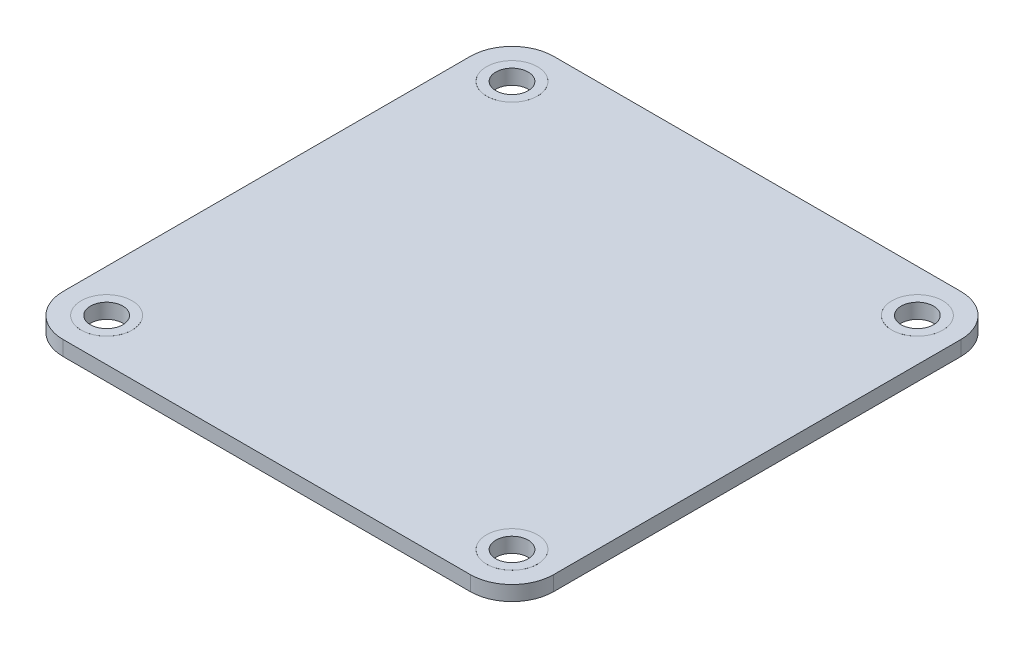
ISO-10303-21;
HEADER;
FILE_DESCRIPTION(('STEP AP214'),'2;1');
FILE_NAME('part.step','',(''),(''),'','','');
FILE_SCHEMA(('AUTOMOTIVE_DESIGN { 1 0 10303 214 1 1 1 1 }'));
ENDSEC;
DATA;
#1=APPLICATION_CONTEXT('core data for automotive mechanical design processes');
#2=APPLICATION_PROTOCOL_DEFINITION('international standard','automotive_design',2000,#1);
#3=PRODUCT_CONTEXT('',#1,'mechanical');
#4=PRODUCT('Part','Part','',(#3));
#5=PRODUCT_RELATED_PRODUCT_CATEGORY('part','',(#4));
#6=PRODUCT_DEFINITION_FORMATION('','',#4);
#7=PRODUCT_DEFINITION_CONTEXT('part definition',#1,'design');
#8=PRODUCT_DEFINITION('design','',#6,#7);
#9=PRODUCT_DEFINITION_SHAPE('','',#8);
#10=(LENGTH_UNIT() NAMED_UNIT(*) SI_UNIT(.MILLI.,.METRE.));
#11=(NAMED_UNIT(*) PLANE_ANGLE_UNIT() SI_UNIT($,.RADIAN.));
#12=(NAMED_UNIT(*) SI_UNIT($,.STERADIAN.) SOLID_ANGLE_UNIT());
#13=UNCERTAINTY_MEASURE_WITH_UNIT(LENGTH_MEASURE(1.E-05),#10,'distance_accuracy_value','');
#14=(GEOMETRIC_REPRESENTATION_CONTEXT(3) GLOBAL_UNCERTAINTY_ASSIGNED_CONTEXT((#13)) GLOBAL_UNIT_ASSIGNED_CONTEXT((#10,
#11,#12)) REPRESENTATION_CONTEXT('',''));
#15=CARTESIAN_POINT('',(0.,0.,0.));
#16=DIRECTION('',(0.,0.,1.));
#17=DIRECTION('',(1.,0.,0.));
#18=AXIS2_PLACEMENT_3D('',#15,#16,#17);
#19=CARTESIAN_POINT('',(-22.,1.6,-22.));
#20=DIRECTION('',(0.,-1.,0.));
#21=DIRECTION('',(0.,0.,-1.));
#22=AXIS2_PLACEMENT_3D('',#19,#20,#21);
#23=PLANE('',#22);
#24=CARTESIAN_POINT('',(21.9,1.6,21.9));
#25=DIRECTION('',(0.,-1.,0.));
#26=DIRECTION('',(0.,0.,-1.));
#27=AXIS2_PLACEMENT_3D('',#24,#25,#26);
#28=CIRCLE('',#27,2.75);
#29=CARTESIAN_POINT('',(21.9,1.6,19.15));
#30=VERTEX_POINT('',#29);
#31=EDGE_CURVE('E42',#30,#30,#28,.F.);
#32=ORIENTED_EDGE('',*,*,#31,.F.);
#33=EDGE_LOOP('',(#32));
#34=FACE_BOUND('',#33,.T.);
#35=CARTESIAN_POINT('',(-21.9,1.6,-21.9));
#36=DIRECTION('',(0.,-1.,0.));
#37=DIRECTION('',(0.,0.,-1.));
#38=AXIS2_PLACEMENT_3D('',#35,#36,#37);
#39=CIRCLE('',#38,2.75);
#40=CARTESIAN_POINT('',(-21.9,1.6,-24.65));
#41=VERTEX_POINT('',#40);
#42=EDGE_CURVE('E162',#41,#41,#39,.F.);
#43=ORIENTED_EDGE('',*,*,#42,.F.);
#44=EDGE_LOOP('',(#43));
#45=FACE_BOUND('',#44,.T.);
#46=CARTESIAN_POINT('',(-22.,1.6,-22.));
#47=DIRECTION('',(0.,1.,0.));
#48=DIRECTION('',(0.,0.,-1.));
#49=AXIS2_PLACEMENT_3D('',#46,#47,#48);
#50=CIRCLE('',#49,4.5);
#51=CARTESIAN_POINT('',(-22.,1.6,-26.5));
#52=VERTEX_POINT('',#51);
#53=CARTESIAN_POINT('',(-26.5,1.6,-22.));
#54=VERTEX_POINT('',#53);
#55=EDGE_CURVE('E147',#52,#54,#50,.T.);
#56=ORIENTED_EDGE('',*,*,#55,.T.);
#57=DIRECTION('',(0.,0.,1.));
#58=VECTOR('',#57,1.);
#59=CARTESIAN_POINT('',(-26.5,1.6,22.));
#60=LINE('',#59,#58);
#61=CARTESIAN_POINT('',(-26.5,1.6,22.));
#62=VERTEX_POINT('',#61);
#63=EDGE_CURVE('E95',#54,#62,#60,.T.);
#64=ORIENTED_EDGE('',*,*,#63,.T.);
#65=CARTESIAN_POINT('',(-22.,1.6,22.));
#66=DIRECTION('',(0.,1.,0.));
#67=DIRECTION('',(0.,0.,-1.));
#68=AXIS2_PLACEMENT_3D('',#65,#66,#67);
#69=CIRCLE('',#68,4.5);
#70=CARTESIAN_POINT('',(-22.,1.6,26.5));
#71=VERTEX_POINT('',#70);
#72=EDGE_CURVE('E217',#62,#71,#69,.T.);
#73=ORIENTED_EDGE('',*,*,#72,.T.);
#74=DIRECTION('',(1.,0.,0.));
#75=VECTOR('',#74,1.);
#76=CARTESIAN_POINT('',(22.,1.6,26.5));
#77=LINE('',#76,#75);
#78=CARTESIAN_POINT('',(22.,1.6,26.5));
#79=VERTEX_POINT('',#78);
#80=EDGE_CURVE('E219',#71,#79,#77,.T.);
#81=ORIENTED_EDGE('',*,*,#80,.T.);
#82=CARTESIAN_POINT('',(22.,1.6,22.));
#83=DIRECTION('',(0.,1.,0.));
#84=DIRECTION('',(0.,0.,-1.));
#85=AXIS2_PLACEMENT_3D('',#82,#83,#84);
#86=CIRCLE('',#85,4.5);
#87=CARTESIAN_POINT('',(26.5,1.6,22.));
#88=VERTEX_POINT('',#87);
#89=EDGE_CURVE('E114',#79,#88,#86,.T.);
#90=ORIENTED_EDGE('',*,*,#89,.T.);
#91=DIRECTION('',(0.,0.,-1.));
#92=VECTOR('',#91,1.);
#93=CARTESIAN_POINT('',(26.5,1.6,22.));
#94=LINE('',#93,#92);
#95=CARTESIAN_POINT('',(26.5,1.6,-22.));
#96=VERTEX_POINT('',#95);
#97=EDGE_CURVE('E108',#88,#96,#94,.T.);
#98=ORIENTED_EDGE('',*,*,#97,.T.);
#99=CARTESIAN_POINT('',(22.,1.6,-22.));
#100=DIRECTION('',(0.,1.,0.));
#101=DIRECTION('',(0.,0.,-1.));
#102=AXIS2_PLACEMENT_3D('',#99,#100,#101);
#103=CIRCLE('',#102,4.5);
#104=CARTESIAN_POINT('',(22.,1.6,-26.5));
#105=VERTEX_POINT('',#104);
#106=EDGE_CURVE('E112',#96,#105,#103,.T.);
#107=ORIENTED_EDGE('',*,*,#106,.T.);
#108=DIRECTION('',(-1.,0.,0.));
#109=VECTOR('',#108,1.);
#110=CARTESIAN_POINT('',(22.,1.6,-26.5));
#111=LINE('',#110,#109);
#112=EDGE_CURVE('E51',#105,#52,#111,.T.);
#113=ORIENTED_EDGE('',*,*,#112,.T.);
#114=EDGE_LOOP('',(#56,#64,#73,#81,#90,#98,#107,#113));
#115=FACE_BOUND('',#114,.T.);
#116=CARTESIAN_POINT('',(21.9,1.6,-21.9));
#117=DIRECTION('',(0.,-1.,0.));
#118=DIRECTION('',(0.,0.,-1.));
#119=AXIS2_PLACEMENT_3D('',#116,#117,#118);
#120=CIRCLE('',#119,2.75);
#121=CARTESIAN_POINT('',(21.9,1.6,-24.65));
#122=VERTEX_POINT('',#121);
#123=EDGE_CURVE('E193',#122,#122,#120,.F.);
#124=ORIENTED_EDGE('',*,*,#123,.F.);
#125=EDGE_LOOP('',(#124));
#126=FACE_BOUND('',#125,.T.);
#127=CARTESIAN_POINT('',(-21.9,1.6,21.9));
#128=DIRECTION('',(0.,-1.,0.));
#129=DIRECTION('',(0.,0.,-1.));
#130=AXIS2_PLACEMENT_3D('',#127,#128,#129);
#131=CIRCLE('',#130,2.75);
#132=CARTESIAN_POINT('',(-21.9,1.6,19.15));
#133=VERTEX_POINT('',#132);
#134=EDGE_CURVE('E11',#133,#133,#131,.F.);
#135=ORIENTED_EDGE('',*,*,#134,.F.);
#136=EDGE_LOOP('',(#135));
#137=FACE_BOUND('',#136,.T.);
#138=ADVANCED_FACE('F32',(#34,#45,#115,#126,#137),#23,.F.);
#139=CARTESIAN_POINT('',(-22.,0.,-22.));
#140=DIRECTION('',(0.,-1.,0.));
#141=DIRECTION('',(0.,0.,-1.));
#142=AXIS2_PLACEMENT_3D('',#139,#140,#141);
#143=PLANE('',#142);
#144=CARTESIAN_POINT('',(21.9,0.,21.9));
#145=DIRECTION('',(0.,-1.,0.));
#146=DIRECTION('',(0.,0.,-1.));
#147=AXIS2_PLACEMENT_3D('',#144,#145,#146);
#148=CIRCLE('',#147,2.75);
#149=CARTESIAN_POINT('',(21.9,0.,19.15));
#150=VERTEX_POINT('',#149);
#151=EDGE_CURVE('E170',#150,#150,#148,.F.);
#152=ORIENTED_EDGE('',*,*,#151,.T.);
#153=EDGE_LOOP('',(#152));
#154=FACE_BOUND('',#153,.T.);
#155=CARTESIAN_POINT('',(-21.9,0.,-21.9));
#156=DIRECTION('',(0.,-1.,0.));
#157=DIRECTION('',(0.,0.,-1.));
#158=AXIS2_PLACEMENT_3D('',#155,#156,#157);
#159=CIRCLE('',#158,2.75);
#160=CARTESIAN_POINT('',(-21.9,0.,-24.65));
#161=VERTEX_POINT('',#160);
#162=EDGE_CURVE('E136',#161,#161,#159,.F.);
#163=ORIENTED_EDGE('',*,*,#162,.T.);
#164=EDGE_LOOP('',(#163));
#165=FACE_BOUND('',#164,.T.);
#166=CARTESIAN_POINT('',(-22.,0.,-22.));
#167=DIRECTION('',(0.,1.,0.));
#168=DIRECTION('',(0.,0.,-1.));
#169=AXIS2_PLACEMENT_3D('',#166,#167,#168);
#170=CIRCLE('',#169,4.5);
#171=CARTESIAN_POINT('',(-22.,0.,-26.5));
#172=VERTEX_POINT('',#171);
#173=CARTESIAN_POINT('',(-26.5,0.,-22.));
#174=VERTEX_POINT('',#173);
#175=EDGE_CURVE('E132',#172,#174,#170,.T.);
#176=ORIENTED_EDGE('',*,*,#175,.F.);
#177=DIRECTION('',(-1.,0.,0.));
#178=VECTOR('',#177,1.);
#179=CARTESIAN_POINT('',(22.,0.,-26.5));
#180=LINE('',#179,#178);
#181=CARTESIAN_POINT('',(22.,0.,-26.5));
#182=VERTEX_POINT('',#181);
#183=EDGE_CURVE('E86',#182,#172,#180,.T.);
#184=ORIENTED_EDGE('',*,*,#183,.F.);
#185=CARTESIAN_POINT('',(22.,0.,-22.));
#186=DIRECTION('',(0.,1.,0.));
#187=DIRECTION('',(0.,0.,-1.));
#188=AXIS2_PLACEMENT_3D('',#185,#186,#187);
#189=CIRCLE('',#188,4.5);
#190=CARTESIAN_POINT('',(26.5,0.,-22.));
#191=VERTEX_POINT('',#190);
#192=EDGE_CURVE('E80',#191,#182,#189,.T.);
#193=ORIENTED_EDGE('',*,*,#192,.F.);
#194=DIRECTION('',(0.,0.,-1.));
#195=VECTOR('',#194,1.);
#196=CARTESIAN_POINT('',(26.5,0.,22.));
#197=LINE('',#196,#195);
#198=CARTESIAN_POINT('',(26.5,0.,22.));
#199=VERTEX_POINT('',#198);
#200=EDGE_CURVE('E122',#199,#191,#197,.T.);
#201=ORIENTED_EDGE('',*,*,#200,.F.);
#202=CARTESIAN_POINT('',(22.,0.,22.));
#203=DIRECTION('',(0.,1.,0.));
#204=DIRECTION('',(0.,0.,-1.));
#205=AXIS2_PLACEMENT_3D('',#202,#203,#204);
#206=CIRCLE('',#205,4.5);
#207=CARTESIAN_POINT('',(22.,0.,26.5));
#208=VERTEX_POINT('',#207);
#209=EDGE_CURVE('E142',#208,#199,#206,.T.);
#210=ORIENTED_EDGE('',*,*,#209,.F.);
#211=DIRECTION('',(1.,0.,0.));
#212=VECTOR('',#211,1.);
#213=CARTESIAN_POINT('',(22.,0.,26.5));
#214=LINE('',#213,#212);
#215=CARTESIAN_POINT('',(-22.,0.,26.5));
#216=VERTEX_POINT('',#215);
#217=EDGE_CURVE('E140',#216,#208,#214,.T.);
#218=ORIENTED_EDGE('',*,*,#217,.F.);
#219=CARTESIAN_POINT('',(-22.,0.,22.));
#220=DIRECTION('',(0.,1.,0.));
#221=DIRECTION('',(0.,0.,-1.));
#222=AXIS2_PLACEMENT_3D('',#219,#220,#221);
#223=CIRCLE('',#222,4.5);
#224=CARTESIAN_POINT('',(-26.5,0.,22.));
#225=VERTEX_POINT('',#224);
#226=EDGE_CURVE('E138',#225,#216,#223,.T.);
#227=ORIENTED_EDGE('',*,*,#226,.F.);
#228=DIRECTION('',(0.,0.,1.));
#229=VECTOR('',#228,1.);
#230=CARTESIAN_POINT('',(-26.5,0.,22.));
#231=LINE('',#230,#229);
#232=EDGE_CURVE('E135',#174,#225,#231,.T.);
#233=ORIENTED_EDGE('',*,*,#232,.F.);
#234=EDGE_LOOP('',(#176,#184,#193,#201,#210,#218,#227,#233));
#235=FACE_BOUND('',#234,.T.);
#236=CARTESIAN_POINT('',(21.9,0.,-21.9));
#237=DIRECTION('',(0.,-1.,0.));
#238=DIRECTION('',(0.,0.,-1.));
#239=AXIS2_PLACEMENT_3D('',#236,#237,#238);
#240=CIRCLE('',#239,2.75);
#241=CARTESIAN_POINT('',(21.9,0.,-24.65));
#242=VERTEX_POINT('',#241);
#243=EDGE_CURVE('E166',#242,#242,#240,.F.);
#244=ORIENTED_EDGE('',*,*,#243,.T.);
#245=EDGE_LOOP('',(#244));
#246=FACE_BOUND('',#245,.T.);
#247=CARTESIAN_POINT('',(-21.9,0.,21.9));
#248=DIRECTION('',(0.,-1.,0.));
#249=DIRECTION('',(0.,0.,-1.));
#250=AXIS2_PLACEMENT_3D('',#247,#248,#249);
#251=CIRCLE('',#250,2.75);
#252=CARTESIAN_POINT('',(-21.9,0.,19.15));
#253=VERTEX_POINT('',#252);
#254=EDGE_CURVE('E36',#253,#253,#251,.F.);
#255=ORIENTED_EDGE('',*,*,#254,.T.);
#256=EDGE_LOOP('',(#255));
#257=FACE_BOUND('',#256,.T.);
#258=ADVANCED_FACE('F232',(#154,#165,#235,#246,#257),#143,.T.);
#259=CARTESIAN_POINT('',(-21.9,1.605,-21.9));
#260=DIRECTION('',(0.,-1.,0.));
#261=DIRECTION('',(0.,0.,-1.));
#262=AXIS2_PLACEMENT_3D('',#259,#260,#261);
#263=CYLINDRICAL_SURFACE('',#262,2.75);
#264=CARTESIAN_POINT('',(-21.9,1.605,-21.9));
#265=DIRECTION('',(0.,1.,0.));
#266=DIRECTION('',(0.,0.,1.));
#267=AXIS2_PLACEMENT_3D('',#264,#265,#266);
#268=CIRCLE('',#267,2.75);
#269=CARTESIAN_POINT('',(-21.9,1.605,-19.15));
#270=VERTEX_POINT('',#269);
#271=EDGE_CURVE('E165',#270,#270,#268,.T.);
#272=ORIENTED_EDGE('',*,*,#271,.F.);
#273=EDGE_LOOP('',(#272));
#274=FACE_BOUND('',#273,.T.);
#275=ORIENTED_EDGE('',*,*,#42,.T.);
#276=EDGE_LOOP('',(#275));
#277=FACE_BOUND('',#276,.T.);
#278=ADVANCED_FACE('F258',(#274,#277),#263,.T.);
#279=CARTESIAN_POINT('',(-21.9,1.605,-21.9));
#280=DIRECTION('',(0.,1.,0.));
#281=DIRECTION('',(0.,0.,1.));
#282=AXIS2_PLACEMENT_3D('',#279,#280,#281);
#283=PLANE('',#282);
#284=ORIENTED_EDGE('',*,*,#271,.T.);
#285=EDGE_LOOP('',(#284));
#286=FACE_BOUND('',#285,.T.);
#287=CARTESIAN_POINT('',(-21.9,1.605,-21.9));
#288=DIRECTION('',(0.,1.,0.));
#289=DIRECTION('',(0.,0.,1.));
#290=AXIS2_PLACEMENT_3D('',#287,#288,#289);
#291=CIRCLE('',#290,1.75);
#292=CARTESIAN_POINT('',(-21.9,1.605,-20.15));
#293=VERTEX_POINT('',#292);
#294=EDGE_CURVE('E203',#293,#293,#291,.T.);
#295=ORIENTED_EDGE('',*,*,#294,.F.);
#296=EDGE_LOOP('',(#295));
#297=FACE_BOUND('',#296,.T.);
#298=ADVANCED_FACE('F270',(#286,#297),#283,.T.);
#299=CARTESIAN_POINT('',(-21.9,-0.00500000000000001,-21.9));
#300=DIRECTION('',(0.,1.,0.));
#301=DIRECTION('',(0.,0.,1.));
#302=AXIS2_PLACEMENT_3D('',#299,#300,#301);
#303=PLANE('',#302);
#304=CARTESIAN_POINT('',(-21.9,-0.00500000000000001,-21.9));
#305=DIRECTION('',(0.,1.,0.));
#306=DIRECTION('',(0.,0.,1.));
#307=AXIS2_PLACEMENT_3D('',#304,#305,#306);
#308=CIRCLE('',#307,2.75);
#309=CARTESIAN_POINT('',(-21.9,-0.00500000000000001,-19.15));
#310=VERTEX_POINT('',#309);
#311=EDGE_CURVE('E206',#310,#310,#308,.T.);
#312=ORIENTED_EDGE('',*,*,#311,.F.);
#313=EDGE_LOOP('',(#312));
#314=FACE_BOUND('',#313,.T.);
#315=CARTESIAN_POINT('',(-21.9,-0.00500000000000001,-21.9));
#316=DIRECTION('',(0.,1.,0.));
#317=DIRECTION('',(0.,0.,1.));
#318=AXIS2_PLACEMENT_3D('',#315,#316,#317);
#319=CIRCLE('',#318,1.75);
#320=CARTESIAN_POINT('',(-21.9,-0.00500000000000001,-20.15));
#321=VERTEX_POINT('',#320);
#322=EDGE_CURVE('E168',#321,#321,#319,.T.);
#323=ORIENTED_EDGE('',*,*,#322,.T.);
#324=EDGE_LOOP('',(#323));
#325=FACE_BOUND('',#324,.T.);
#326=ADVANCED_FACE('F266',(#314,#325),#303,.F.);
#327=ORIENTED_EDGE('',*,*,#162,.F.);
#328=EDGE_LOOP('',(#327));
#329=FACE_BOUND('',#328,.T.);
#330=ORIENTED_EDGE('',*,*,#311,.T.);
#331=EDGE_LOOP('',(#330));
#332=FACE_BOUND('',#331,.T.);
#333=ADVANCED_FACE('F262',(#329,#332),#263,.T.);
#334=CARTESIAN_POINT('',(-21.9,1.605,-21.9));
#335=DIRECTION('',(0.,-1.,0.));
#336=DIRECTION('',(0.,0.,-1.));
#337=AXIS2_PLACEMENT_3D('',#334,#335,#336);
#338=CYLINDRICAL_SURFACE('',#337,1.75);
#339=ORIENTED_EDGE('',*,*,#294,.T.);
#340=EDGE_LOOP('',(#339));
#341=FACE_BOUND('',#340,.T.);
#342=ORIENTED_EDGE('',*,*,#322,.F.);
#343=EDGE_LOOP('',(#342));
#344=FACE_BOUND('',#343,.T.);
#345=ADVANCED_FACE('F265',(#341,#344),#338,.F.);
#346=CARTESIAN_POINT('',(-22.,1.6,-22.));
#347=DIRECTION('',(0.,-1.,0.));
#348=DIRECTION('',(0.,0.,-1.));
#349=AXIS2_PLACEMENT_3D('',#346,#347,#348);
#350=CYLINDRICAL_SURFACE('',#349,4.5);
#351=ORIENTED_EDGE('',*,*,#175,.T.);
#352=DIRECTION('',(0.,-1.,0.));
#353=VECTOR('',#352,1.);
#354=CARTESIAN_POINT('',(-26.5,1.6,-22.));
#355=LINE('',#354,#353);
#356=EDGE_CURVE('E160',#54,#174,#355,.T.);
#357=ORIENTED_EDGE('',*,*,#356,.F.);
#358=ORIENTED_EDGE('',*,*,#55,.F.);
#359=DIRECTION('',(0.,-1.,0.));
#360=VECTOR('',#359,1.);
#361=CARTESIAN_POINT('',(-22.,1.6,-26.5));
#362=LINE('',#361,#360);
#363=EDGE_CURVE('E128',#52,#172,#362,.T.);
#364=ORIENTED_EDGE('',*,*,#363,.T.);
#365=EDGE_LOOP('',(#351,#357,#358,#364));
#366=FACE_BOUND('',#365,.T.);
#367=ADVANCED_FACE('F34',(#366),#350,.T.);
#368=CARTESIAN_POINT('',(-26.5,1.6,22.));
#369=DIRECTION('',(1.,0.,0.));
#370=DIRECTION('',(0.,0.,-1.));
#371=AXIS2_PLACEMENT_3D('',#368,#369,#370);
#372=PLANE('',#371);
#373=ORIENTED_EDGE('',*,*,#232,.T.);
#374=DIRECTION('',(0.,-1.,0.));
#375=VECTOR('',#374,1.);
#376=CARTESIAN_POINT('',(-26.5,1.6,22.));
#377=LINE('',#376,#375);
#378=EDGE_CURVE('E157',#62,#225,#377,.T.);
#379=ORIENTED_EDGE('',*,*,#378,.F.);
#380=ORIENTED_EDGE('',*,*,#63,.F.);
#381=ORIENTED_EDGE('',*,*,#356,.T.);
#382=EDGE_LOOP('',(#373,#379,#380,#381));
#383=FACE_BOUND('',#382,.T.);
#384=ADVANCED_FACE('F514',(#383),#372,.F.);
#385=CARTESIAN_POINT('',(-22.,1.6,22.));
#386=DIRECTION('',(0.,-1.,0.));
#387=DIRECTION('',(0.,0.,-1.));
#388=AXIS2_PLACEMENT_3D('',#385,#386,#387);
#389=CYLINDRICAL_SURFACE('',#388,4.5);
#390=ORIENTED_EDGE('',*,*,#226,.T.);
#391=DIRECTION('',(0.,-1.,0.));
#392=VECTOR('',#391,1.);
#393=CARTESIAN_POINT('',(-22.,1.6,26.5));
#394=LINE('',#393,#392);
#395=EDGE_CURVE('E154',#71,#216,#394,.T.);
#396=ORIENTED_EDGE('',*,*,#395,.F.);
#397=ORIENTED_EDGE('',*,*,#72,.F.);
#398=ORIENTED_EDGE('',*,*,#378,.T.);
#399=EDGE_LOOP('',(#390,#396,#397,#398));
#400=FACE_BOUND('',#399,.T.);
#401=ADVANCED_FACE('F506',(#400),#389,.T.);
#402=CARTESIAN_POINT('',(22.,1.6,26.5));
#403=DIRECTION('',(0.,0.,-1.));
#404=DIRECTION('',(-1.,0.,0.));
#405=AXIS2_PLACEMENT_3D('',#402,#403,#404);
#406=PLANE('',#405);
#407=ORIENTED_EDGE('',*,*,#217,.T.);
#408=DIRECTION('',(0.,-1.,0.));
#409=VECTOR('',#408,1.);
#410=CARTESIAN_POINT('',(22.,1.6,26.5));
#411=LINE('',#410,#409);
#412=EDGE_CURVE('E151',#79,#208,#411,.T.);
#413=ORIENTED_EDGE('',*,*,#412,.F.);
#414=ORIENTED_EDGE('',*,*,#80,.F.);
#415=ORIENTED_EDGE('',*,*,#395,.T.);
#416=EDGE_LOOP('',(#407,#413,#414,#415));
#417=FACE_BOUND('',#416,.T.);
#418=ADVANCED_FACE('F225',(#417),#406,.F.);
#419=CARTESIAN_POINT('',(22.,1.6,22.));
#420=DIRECTION('',(0.,-1.,0.));
#421=DIRECTION('',(0.,0.,-1.));
#422=AXIS2_PLACEMENT_3D('',#419,#420,#421);
#423=CYLINDRICAL_SURFACE('',#422,4.5);
#424=ORIENTED_EDGE('',*,*,#209,.T.);
#425=DIRECTION('',(0.,-1.,0.));
#426=VECTOR('',#425,1.);
#427=CARTESIAN_POINT('',(26.5,1.6,22.));
#428=LINE('',#427,#426);
#429=EDGE_CURVE('E123',#88,#199,#428,.T.);
#430=ORIENTED_EDGE('',*,*,#429,.F.);
#431=ORIENTED_EDGE('',*,*,#89,.F.);
#432=ORIENTED_EDGE('',*,*,#412,.T.);
#433=EDGE_LOOP('',(#424,#430,#431,#432));
#434=FACE_BOUND('',#433,.T.);
#435=ADVANCED_FACE('F229',(#434),#423,.T.);
#436=CARTESIAN_POINT('',(26.5,1.6,22.));
#437=DIRECTION('',(-1.,0.,0.));
#438=DIRECTION('',(0.,0.,1.));
#439=AXIS2_PLACEMENT_3D('',#436,#437,#438);
#440=PLANE('',#439);
#441=ORIENTED_EDGE('',*,*,#200,.T.);
#442=DIRECTION('',(0.,-1.,0.));
#443=VECTOR('',#442,1.);
#444=CARTESIAN_POINT('',(26.5,1.6,-22.));
#445=LINE('',#444,#443);
#446=EDGE_CURVE('E119',#96,#191,#445,.T.);
#447=ORIENTED_EDGE('',*,*,#446,.F.);
#448=ORIENTED_EDGE('',*,*,#97,.F.);
#449=ORIENTED_EDGE('',*,*,#429,.T.);
#450=EDGE_LOOP('',(#441,#447,#448,#449));
#451=FACE_BOUND('',#450,.T.);
#452=ADVANCED_FACE('F120',(#451),#440,.F.);
#453=CARTESIAN_POINT('',(22.,1.6,-22.));
#454=DIRECTION('',(0.,-1.,0.));
#455=DIRECTION('',(0.,0.,-1.));
#456=AXIS2_PLACEMENT_3D('',#453,#454,#455);
#457=CYLINDRICAL_SURFACE('',#456,4.5);
#458=ORIENTED_EDGE('',*,*,#192,.T.);
#459=DIRECTION('',(0.,-1.,0.));
#460=VECTOR('',#459,1.);
#461=CARTESIAN_POINT('',(22.,1.6,-26.5));
#462=LINE('',#461,#460);
#463=EDGE_CURVE('E124',#105,#182,#462,.T.);
#464=ORIENTED_EDGE('',*,*,#463,.F.);
#465=ORIENTED_EDGE('',*,*,#106,.F.);
#466=ORIENTED_EDGE('',*,*,#446,.T.);
#467=EDGE_LOOP('',(#458,#464,#465,#466));
#468=FACE_BOUND('',#467,.T.);
#469=ADVANCED_FACE('F126',(#468),#457,.T.);
#470=CARTESIAN_POINT('',(22.,1.6,-26.5));
#471=DIRECTION('',(0.,0.,1.));
#472=DIRECTION('',(1.,0.,0.));
#473=AXIS2_PLACEMENT_3D('',#470,#471,#472);
#474=PLANE('',#473);
#475=ORIENTED_EDGE('',*,*,#183,.T.);
#476=ORIENTED_EDGE('',*,*,#363,.F.);
#477=ORIENTED_EDGE('',*,*,#112,.F.);
#478=ORIENTED_EDGE('',*,*,#463,.T.);
#479=EDGE_LOOP('',(#475,#476,#477,#478));
#480=FACE_BOUND('',#479,.T.);
#481=ADVANCED_FACE('F238',(#480),#474,.F.);
#482=CARTESIAN_POINT('',(21.9,1.605,-21.9));
#483=DIRECTION('',(0.,-1.,0.));
#484=DIRECTION('',(0.,0.,-1.));
#485=AXIS2_PLACEMENT_3D('',#482,#483,#484);
#486=CYLINDRICAL_SURFACE('',#485,2.75);
#487=CARTESIAN_POINT('',(21.9,1.605,-21.9));
#488=DIRECTION('',(0.,1.,0.));
#489=DIRECTION('',(0.,0.,1.));
#490=AXIS2_PLACEMENT_3D('',#487,#488,#489);
#491=CIRCLE('',#490,2.75);
#492=CARTESIAN_POINT('',(21.9,1.605,-19.15));
#493=VERTEX_POINT('',#492);
#494=EDGE_CURVE('E169',#493,#493,#491,.T.);
#495=ORIENTED_EDGE('',*,*,#494,.F.);
#496=EDGE_LOOP('',(#495));
#497=FACE_BOUND('',#496,.T.);
#498=ORIENTED_EDGE('',*,*,#123,.T.);
#499=EDGE_LOOP('',(#498));
#500=FACE_BOUND('',#499,.T.);
#501=ADVANCED_FACE('F240',(#497,#500),#486,.T.);
#502=CARTESIAN_POINT('',(21.9,1.605,-21.9));
#503=DIRECTION('',(0.,1.,0.));
#504=DIRECTION('',(0.,0.,1.));
#505=AXIS2_PLACEMENT_3D('',#502,#503,#504);
#506=PLANE('',#505);
#507=ORIENTED_EDGE('',*,*,#494,.T.);
#508=EDGE_LOOP('',(#507));
#509=FACE_BOUND('',#508,.T.);
#510=CARTESIAN_POINT('',(21.9,1.605,-21.9));
#511=DIRECTION('',(0.,1.,0.));
#512=DIRECTION('',(0.,0.,1.));
#513=AXIS2_PLACEMENT_3D('',#510,#511,#512);
#514=CIRCLE('',#513,1.75);
#515=CARTESIAN_POINT('',(21.9,1.605,-20.15));
#516=VERTEX_POINT('',#515);
#517=EDGE_CURVE('E177',#516,#516,#514,.T.);
#518=ORIENTED_EDGE('',*,*,#517,.F.);
#519=EDGE_LOOP('',(#518));
#520=FACE_BOUND('',#519,.T.);
#521=ADVANCED_FACE('F246',(#509,#520),#506,.T.);
#522=CARTESIAN_POINT('',(21.9,-0.00500000000000001,-21.9));
#523=DIRECTION('',(0.,1.,0.));
#524=DIRECTION('',(0.,0.,1.));
#525=AXIS2_PLACEMENT_3D('',#522,#523,#524);
#526=PLANE('',#525);
#527=CARTESIAN_POINT('',(21.9,-0.00500000000000001,-21.9));
#528=DIRECTION('',(0.,1.,0.));
#529=DIRECTION('',(0.,0.,1.));
#530=AXIS2_PLACEMENT_3D('',#527,#528,#529);
#531=CIRCLE('',#530,2.75);
#532=CARTESIAN_POINT('',(21.9,-0.00500000000000001,-19.15));
#533=VERTEX_POINT('',#532);
#534=EDGE_CURVE('E195',#533,#533,#531,.T.);
#535=ORIENTED_EDGE('',*,*,#534,.F.);
#536=EDGE_LOOP('',(#535));
#537=FACE_BOUND('',#536,.T.);
#538=CARTESIAN_POINT('',(21.9,-0.00500000000000001,-21.9));
#539=DIRECTION('',(0.,1.,0.));
#540=DIRECTION('',(0.,0.,1.));
#541=AXIS2_PLACEMENT_3D('',#538,#539,#540);
#542=CIRCLE('',#541,1.75);
#543=CARTESIAN_POINT('',(21.9,-0.00500000000000001,-20.15));
#544=VERTEX_POINT('',#543);
#545=EDGE_CURVE('E172',#544,#544,#542,.T.);
#546=ORIENTED_EDGE('',*,*,#545,.T.);
#547=EDGE_LOOP('',(#546));
#548=FACE_BOUND('',#547,.T.);
#549=ADVANCED_FACE('F280',(#537,#548),#526,.F.);
#550=ORIENTED_EDGE('',*,*,#243,.F.);
#551=EDGE_LOOP('',(#550));
#552=FACE_BOUND('',#551,.T.);
#553=ORIENTED_EDGE('',*,*,#534,.T.);
#554=EDGE_LOOP('',(#553));
#555=FACE_BOUND('',#554,.T.);
#556=ADVANCED_FACE('F249',(#552,#555),#486,.T.);
#557=CARTESIAN_POINT('',(21.9,1.605,-21.9));
#558=DIRECTION('',(0.,-1.,0.));
#559=DIRECTION('',(0.,0.,-1.));
#560=AXIS2_PLACEMENT_3D('',#557,#558,#559);
#561=CYLINDRICAL_SURFACE('',#560,1.75);
#562=ORIENTED_EDGE('',*,*,#517,.T.);
#563=EDGE_LOOP('',(#562));
#564=FACE_BOUND('',#563,.T.);
#565=ORIENTED_EDGE('',*,*,#545,.F.);
#566=EDGE_LOOP('',(#565));
#567=FACE_BOUND('',#566,.T.);
#568=ADVANCED_FACE('F279',(#564,#567),#561,.F.);
#569=CARTESIAN_POINT('',(21.9,1.605,21.9));
#570=DIRECTION('',(0.,-1.,0.));
#571=DIRECTION('',(0.,0.,-1.));
#572=AXIS2_PLACEMENT_3D('',#569,#570,#571);
#573=CYLINDRICAL_SURFACE('',#572,2.75);
#574=CARTESIAN_POINT('',(21.9,1.605,21.9));
#575=DIRECTION('',(0.,1.,0.));
#576=DIRECTION('',(0.,0.,1.));
#577=AXIS2_PLACEMENT_3D('',#574,#575,#576);
#578=CIRCLE('',#577,2.75);
#579=CARTESIAN_POINT('',(21.9,1.605,24.65));
#580=VERTEX_POINT('',#579);
#581=EDGE_CURVE('E173',#580,#580,#578,.T.);
#582=ORIENTED_EDGE('',*,*,#581,.F.);
#583=EDGE_LOOP('',(#582));
#584=FACE_BOUND('',#583,.T.);
#585=ORIENTED_EDGE('',*,*,#31,.T.);
#586=EDGE_LOOP('',(#585));
#587=FACE_BOUND('',#586,.T.);
#588=ADVANCED_FACE('F290',(#584,#587),#573,.T.);
#589=CARTESIAN_POINT('',(21.9,1.605,21.9));
#590=DIRECTION('',(0.,1.,0.));
#591=DIRECTION('',(0.,0.,1.));
#592=AXIS2_PLACEMENT_3D('',#589,#590,#591);
#593=PLANE('',#592);
#594=ORIENTED_EDGE('',*,*,#581,.T.);
#595=EDGE_LOOP('',(#594));
#596=FACE_BOUND('',#595,.T.);
#597=CARTESIAN_POINT('',(21.9,1.605,21.9));
#598=DIRECTION('',(0.,1.,0.));
#599=DIRECTION('',(0.,0.,1.));
#600=AXIS2_PLACEMENT_3D('',#597,#598,#599);
#601=CIRCLE('',#600,1.75);
#602=CARTESIAN_POINT('',(21.9,1.605,23.65));
#603=VERTEX_POINT('',#602);
#604=EDGE_CURVE('E185',#603,#603,#601,.T.);
#605=ORIENTED_EDGE('',*,*,#604,.F.);
#606=EDGE_LOOP('',(#605));
#607=FACE_BOUND('',#606,.T.);
#608=ADVANCED_FACE('F300',(#596,#607),#593,.T.);
#609=CARTESIAN_POINT('',(21.9,-0.00500000000000001,21.9));
#610=DIRECTION('',(0.,1.,0.));
#611=DIRECTION('',(0.,0.,1.));
#612=AXIS2_PLACEMENT_3D('',#609,#610,#611);
#613=PLANE('',#612);
#614=CARTESIAN_POINT('',(21.9,-0.00500000000000001,21.9));
#615=DIRECTION('',(0.,1.,0.));
#616=DIRECTION('',(0.,0.,1.));
#617=AXIS2_PLACEMENT_3D('',#614,#615,#616);
#618=CIRCLE('',#617,2.75);
#619=CARTESIAN_POINT('',(21.9,-0.00500000000000001,24.65));
#620=VERTEX_POINT('',#619);
#621=EDGE_CURVE('E180',#620,#620,#618,.T.);
#622=ORIENTED_EDGE('',*,*,#621,.F.);
#623=EDGE_LOOP('',(#622));
#624=FACE_BOUND('',#623,.T.);
#625=CARTESIAN_POINT('',(21.9,-0.00500000000000001,21.9));
#626=DIRECTION('',(0.,1.,0.));
#627=DIRECTION('',(0.,0.,1.));
#628=AXIS2_PLACEMENT_3D('',#625,#626,#627);
#629=CIRCLE('',#628,1.75);
#630=CARTESIAN_POINT('',(21.9,-0.00500000000000001,23.65));
#631=VERTEX_POINT('',#630);
#632=EDGE_CURVE('E188',#631,#631,#629,.T.);
#633=ORIENTED_EDGE('',*,*,#632,.T.);
#634=EDGE_LOOP('',(#633));
#635=FACE_BOUND('',#634,.T.);
#636=ADVANCED_FACE('F296',(#624,#635),#613,.F.);
#637=ORIENTED_EDGE('',*,*,#151,.F.);
#638=EDGE_LOOP('',(#637));
#639=FACE_BOUND('',#638,.T.);
#640=ORIENTED_EDGE('',*,*,#621,.T.);
#641=EDGE_LOOP('',(#640));
#642=FACE_BOUND('',#641,.T.);
#643=ADVANCED_FACE('F292',(#639,#642),#573,.T.);
#644=CARTESIAN_POINT('',(21.9,1.605,21.9));
#645=DIRECTION('',(0.,-1.,0.));
#646=DIRECTION('',(0.,0.,-1.));
#647=AXIS2_PLACEMENT_3D('',#644,#645,#646);
#648=CYLINDRICAL_SURFACE('',#647,1.75);
#649=ORIENTED_EDGE('',*,*,#604,.T.);
#650=EDGE_LOOP('',(#649));
#651=FACE_BOUND('',#650,.T.);
#652=ORIENTED_EDGE('',*,*,#632,.F.);
#653=EDGE_LOOP('',(#652));
#654=FACE_BOUND('',#653,.T.);
#655=ADVANCED_FACE('F295',(#651,#654),#648,.F.);
#656=CARTESIAN_POINT('',(-21.9,1.605,21.9));
#657=DIRECTION('',(0.,-1.,0.));
#658=DIRECTION('',(0.,0.,-1.));
#659=AXIS2_PLACEMENT_3D('',#656,#657,#658);
#660=CYLINDRICAL_SURFACE('',#659,2.75);
#661=CARTESIAN_POINT('',(-21.9,1.605,21.9));
#662=DIRECTION('',(0.,1.,0.));
#663=DIRECTION('',(0.,0.,1.));
#664=AXIS2_PLACEMENT_3D('',#661,#662,#663);
#665=CIRCLE('',#664,2.75);
#666=CARTESIAN_POINT('',(-21.9,1.605,24.65));
#667=VERTEX_POINT('',#666);
#668=EDGE_CURVE('E337',#667,#667,#665,.T.);
#669=ORIENTED_EDGE('',*,*,#668,.F.);
#670=EDGE_LOOP('',(#669));
#671=FACE_BOUND('',#670,.T.);
#672=ORIENTED_EDGE('',*,*,#134,.T.);
#673=EDGE_LOOP('',(#672));
#674=FACE_BOUND('',#673,.T.);
#675=ADVANCED_FACE('F306',(#671,#674),#660,.T.);
#676=CARTESIAN_POINT('',(-21.9,1.605,21.9));
#677=DIRECTION('',(0.,1.,0.));
#678=DIRECTION('',(0.,0.,1.));
#679=AXIS2_PLACEMENT_3D('',#676,#677,#678);
#680=PLANE('',#679);
#681=ORIENTED_EDGE('',*,*,#668,.T.);
#682=EDGE_LOOP('',(#681));
#683=FACE_BOUND('',#682,.T.);
#684=CARTESIAN_POINT('',(-21.9,1.605,21.9));
#685=DIRECTION('',(0.,1.,0.));
#686=DIRECTION('',(0.,0.,1.));
#687=AXIS2_PLACEMENT_3D('',#684,#685,#686);
#688=CIRCLE('',#687,1.75);
#689=CARTESIAN_POINT('',(-21.9,1.605,23.65));
#690=VERTEX_POINT('',#689);
#691=EDGE_CURVE('E328',#690,#690,#688,.T.);
#692=ORIENTED_EDGE('',*,*,#691,.F.);
#693=EDGE_LOOP('',(#692));
#694=FACE_BOUND('',#693,.T.);
#695=ADVANCED_FACE('F316',(#683,#694),#680,.T.);
#696=CARTESIAN_POINT('',(-21.9,-0.00500000000000001,21.9));
#697=DIRECTION('',(0.,1.,0.));
#698=DIRECTION('',(0.,0.,1.));
#699=AXIS2_PLACEMENT_3D('',#696,#697,#698);
#700=PLANE('',#699);
#701=CARTESIAN_POINT('',(-21.9,-0.00500000000000001,21.9));
#702=DIRECTION('',(0.,1.,0.));
#703=DIRECTION('',(0.,0.,1.));
#704=AXIS2_PLACEMENT_3D('',#701,#702,#703);
#705=CIRCLE('',#704,2.75);
#706=CARTESIAN_POINT('',(-21.9,-0.00500000000000001,24.65));
#707=VERTEX_POINT('',#706);
#708=EDGE_CURVE('E334',#707,#707,#705,.T.);
#709=ORIENTED_EDGE('',*,*,#708,.F.);
#710=EDGE_LOOP('',(#709));
#711=FACE_BOUND('',#710,.T.);
#712=CARTESIAN_POINT('',(-21.9,-0.00500000000000001,21.9));
#713=DIRECTION('',(0.,1.,0.));
#714=DIRECTION('',(0.,0.,1.));
#715=AXIS2_PLACEMENT_3D('',#712,#713,#714);
#716=CIRCLE('',#715,1.75);
#717=CARTESIAN_POINT('',(-21.9,-0.00500000000000001,23.65));
#718=VERTEX_POINT('',#717);
#719=EDGE_CURVE('E331',#718,#718,#716,.T.);
#720=ORIENTED_EDGE('',*,*,#719,.T.);
#721=EDGE_LOOP('',(#720));
#722=FACE_BOUND('',#721,.T.);
#723=ADVANCED_FACE('F312',(#711,#722),#700,.F.);
#724=ORIENTED_EDGE('',*,*,#254,.F.);
#725=EDGE_LOOP('',(#724));
#726=FACE_BOUND('',#725,.T.);
#727=ORIENTED_EDGE('',*,*,#708,.T.);
#728=EDGE_LOOP('',(#727));
#729=FACE_BOUND('',#728,.T.);
#730=ADVANCED_FACE('F308',(#726,#729),#660,.T.);
#731=CARTESIAN_POINT('',(-21.9,1.605,21.9));
#732=DIRECTION('',(0.,-1.,0.));
#733=DIRECTION('',(0.,0.,-1.));
#734=AXIS2_PLACEMENT_3D('',#731,#732,#733);
#735=CYLINDRICAL_SURFACE('',#734,1.75);
#736=ORIENTED_EDGE('',*,*,#691,.T.);
#737=EDGE_LOOP('',(#736));
#738=FACE_BOUND('',#737,.T.);
#739=ORIENTED_EDGE('',*,*,#719,.F.);
#740=EDGE_LOOP('',(#739));
#741=FACE_BOUND('',#740,.T.);
#742=ADVANCED_FACE('F311',(#738,#741),#735,.F.);
#743=CLOSED_SHELL('',(#138,#258,#278,#298,#326,#333,#345,#367,#384,#401,#418,#435,#452,#469,
#481,#501,#521,#549,#556,#568,#588,#608,#636,#643,#655,#675,#695,#723,#730,#742));
#744=MANIFOLD_SOLID_BREP('B2',#743);
#745=ADVANCED_BREP_SHAPE_REPRESENTATION('',(#18,#744),#14);
#746=SHAPE_DEFINITION_REPRESENTATION(#9,#745);
ENDSEC;
END-ISO-10303-21;
